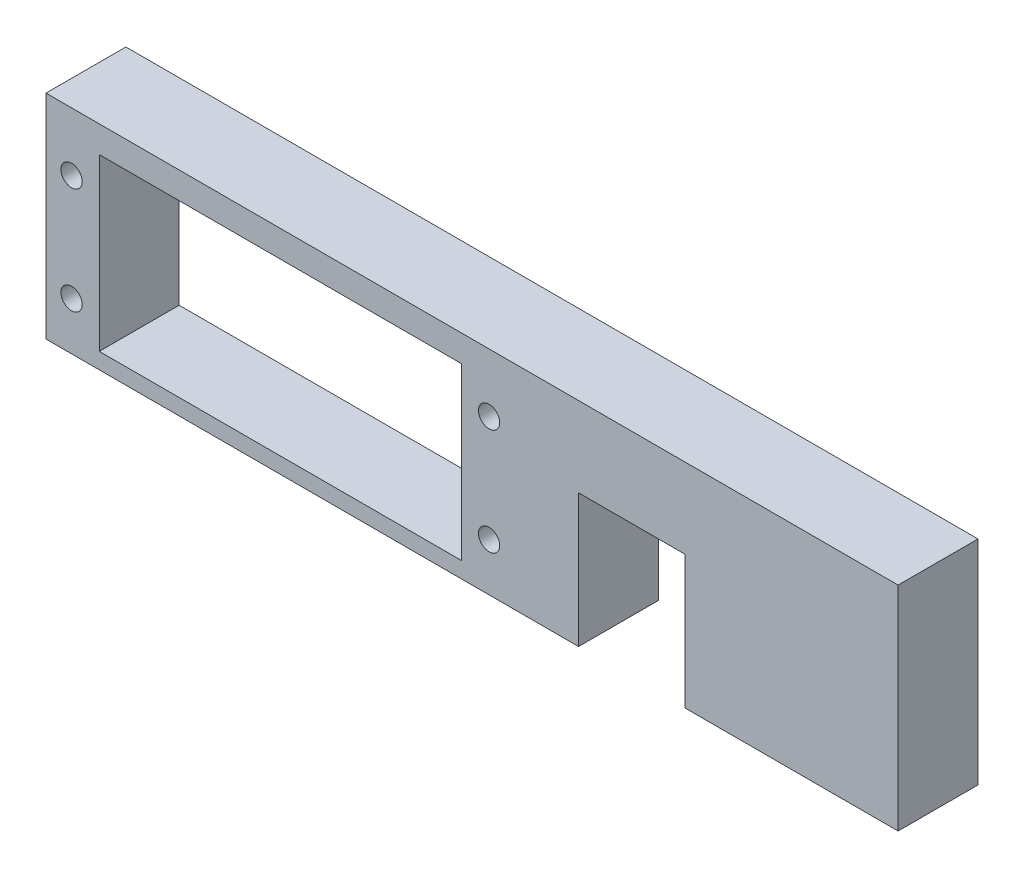
ISO-10303-21;
HEADER;
FILE_DESCRIPTION(('STEP AP214'),'2;1');
FILE_NAME('part.step','',(''),(''),'','','');
FILE_SCHEMA(('AUTOMOTIVE_DESIGN { 1 0 10303 214 1 1 1 1 }'));
ENDSEC;
DATA;
#1=APPLICATION_CONTEXT('core data for automotive mechanical design processes');
#2=APPLICATION_PROTOCOL_DEFINITION('international standard','automotive_design',2000,#1);
#3=PRODUCT_CONTEXT('',#1,'mechanical');
#4=PRODUCT('Part','Part','',(#3));
#5=PRODUCT_RELATED_PRODUCT_CATEGORY('part','',(#4));
#6=PRODUCT_DEFINITION_FORMATION('','',#4);
#7=PRODUCT_DEFINITION_CONTEXT('part definition',#1,'design');
#8=PRODUCT_DEFINITION('design','',#6,#7);
#9=PRODUCT_DEFINITION_SHAPE('','',#8);
#10=(LENGTH_UNIT() NAMED_UNIT(*) SI_UNIT(.MILLI.,.METRE.));
#11=(NAMED_UNIT(*) PLANE_ANGLE_UNIT() SI_UNIT($,.RADIAN.));
#12=(NAMED_UNIT(*) SI_UNIT($,.STERADIAN.) SOLID_ANGLE_UNIT());
#13=UNCERTAINTY_MEASURE_WITH_UNIT(LENGTH_MEASURE(1.E-05),#10,'distance_accuracy_value','');
#14=(GEOMETRIC_REPRESENTATION_CONTEXT(3) GLOBAL_UNCERTAINTY_ASSIGNED_CONTEXT((#13)) GLOBAL_UNIT_ASSIGNED_CONTEXT((#10,
#11,#12)) REPRESENTATION_CONTEXT('',''));
#15=CARTESIAN_POINT('',(0.,0.,0.));
#16=DIRECTION('',(0.,0.,1.));
#17=DIRECTION('',(1.,0.,0.));
#18=AXIS2_PLACEMENT_3D('',#15,#16,#17);
#19=CARTESIAN_POINT('',(0.,0.,9.525));
#20=DIRECTION('',(0.,0.,-1.));
#21=DIRECTION('',(-1.,0.,0.));
#22=AXIS2_PLACEMENT_3D('',#19,#20,#21);
#23=PLANE('',#22);
#24=CARTESIAN_POINT('',(52.832,18.415,9.525));
#25=DIRECTION('',(0.,0.,1.));
#26=DIRECTION('',(1.,0.,0.));
#27=AXIS2_PLACEMENT_3D('',#24,#25,#26);
#28=CIRCLE('',#27,1.27);
#29=CARTESIAN_POINT('',(54.102,18.415,9.525));
#30=VERTEX_POINT('',#29);
#31=EDGE_CURVE('E350',#30,#30,#28,.T.);
#32=ORIENTED_EDGE('',*,*,#31,.F.);
#33=EDGE_LOOP('',(#32));
#34=FACE_BOUND('',#33,.T.);
#35=CARTESIAN_POINT('',(3.04799999999999,18.415,9.525));
#36=DIRECTION('',(0.,0.,1.));
#37=DIRECTION('',(1.,0.,0.));
#38=AXIS2_PLACEMENT_3D('',#35,#36,#37);
#39=CIRCLE('',#38,1.27);
#40=CARTESIAN_POINT('',(4.31799999999999,18.415,9.525));
#41=VERTEX_POINT('',#40);
#42=EDGE_CURVE('E154',#41,#41,#39,.T.);
#43=ORIENTED_EDGE('',*,*,#42,.F.);
#44=EDGE_LOOP('',(#43));
#45=FACE_BOUND('',#44,.T.);
#46=DIRECTION('',(0.,-1.,0.));
#47=VECTOR('',#46,1.);
#48=CARTESIAN_POINT('',(0.,0.,9.525));
#49=LINE('',#48,#47);
#50=CARTESIAN_POINT('',(0.,25.4,9.525));
#51=VERTEX_POINT('',#50);
#52=CARTESIAN_POINT('',(0.,0.,9.525));
#53=VERTEX_POINT('',#52);
#54=EDGE_CURVE('E164',#51,#53,#49,.T.);
#55=ORIENTED_EDGE('',*,*,#54,.T.);
#56=DIRECTION('',(1.,0.,0.));
#57=VECTOR('',#56,1.);
#58=CARTESIAN_POINT('',(0.,0.,9.525));
#59=LINE('',#58,#57);
#60=CARTESIAN_POINT('',(63.5,0.,9.525));
#61=VERTEX_POINT('',#60);
#62=EDGE_CURVE('E167',#53,#61,#59,.T.);
#63=ORIENTED_EDGE('',*,*,#62,.T.);
#64=DIRECTION('',(0.,1.,0.));
#65=VECTOR('',#64,1.);
#66=CARTESIAN_POINT('',(63.5,0.,9.525));
#67=LINE('',#66,#65);
#68=CARTESIAN_POINT('',(63.5,15.875,9.525));
#69=VERTEX_POINT('',#68);
#70=EDGE_CURVE('E170',#61,#69,#67,.T.);
#71=ORIENTED_EDGE('',*,*,#70,.T.);
#72=DIRECTION('',(1.,0.,0.));
#73=VECTOR('',#72,1.);
#74=CARTESIAN_POINT('',(63.5,15.875,9.525));
#75=LINE('',#74,#73);
#76=CARTESIAN_POINT('',(76.2,15.875,9.525));
#77=VERTEX_POINT('',#76);
#78=EDGE_CURVE('E172',#69,#77,#75,.T.);
#79=ORIENTED_EDGE('',*,*,#78,.T.);
#80=DIRECTION('',(0.,-1.,0.));
#81=VECTOR('',#80,1.);
#82=CARTESIAN_POINT('',(76.2,15.875,9.525));
#83=LINE('',#82,#81);
#84=CARTESIAN_POINT('',(76.2,0.,9.525));
#85=VERTEX_POINT('',#84);
#86=EDGE_CURVE('E174',#77,#85,#83,.T.);
#87=ORIENTED_EDGE('',*,*,#86,.T.);
#88=DIRECTION('',(1.,0.,0.));
#89=VECTOR('',#88,1.);
#90=CARTESIAN_POINT('',(76.2,0.,9.525));
#91=LINE('',#90,#89);
#92=CARTESIAN_POINT('',(101.6,0.,9.525));
#93=VERTEX_POINT('',#92);
#94=EDGE_CURVE('E176',#85,#93,#91,.T.);
#95=ORIENTED_EDGE('',*,*,#94,.T.);
#96=DIRECTION('',(0.,1.,0.));
#97=VECTOR('',#96,1.);
#98=CARTESIAN_POINT('',(101.6,0.,9.525));
#99=LINE('',#98,#97);
#100=CARTESIAN_POINT('',(101.6,25.4,9.525));
#101=VERTEX_POINT('',#100);
#102=EDGE_CURVE('E178',#93,#101,#99,.T.);
#103=ORIENTED_EDGE('',*,*,#102,.T.);
#104=DIRECTION('',(-1.,0.,0.));
#105=VECTOR('',#104,1.);
#106=CARTESIAN_POINT('',(0.,25.4,9.525));
#107=LINE('',#106,#105);
#108=EDGE_CURVE('E180',#101,#51,#107,.T.);
#109=ORIENTED_EDGE('',*,*,#108,.T.);
#110=EDGE_LOOP('',(#55,#63,#71,#79,#87,#95,#103,#109));
#111=FACE_BOUND('',#110,.T.);
#112=DIRECTION('',(0.,-1.,0.));
#113=VECTOR('',#112,1.);
#114=CARTESIAN_POINT('',(6.35,22.225,9.525));
#115=LINE('',#114,#113);
#116=CARTESIAN_POINT('',(6.35,22.225,9.525));
#117=VERTEX_POINT('',#116);
#118=CARTESIAN_POINT('',(6.35,1.90500000000001,9.525));
#119=VERTEX_POINT('',#118);
#120=EDGE_CURVE('E125',#117,#119,#115,.T.);
#121=ORIENTED_EDGE('',*,*,#120,.F.);
#122=DIRECTION('',(-1.,0.,0.));
#123=VECTOR('',#122,1.);
#124=CARTESIAN_POINT('',(6.35,22.225,9.525));
#125=LINE('',#124,#123);
#126=CARTESIAN_POINT('',(49.53,22.225,9.525));
#127=VERTEX_POINT('',#126);
#128=EDGE_CURVE('E148',#127,#117,#125,.T.);
#129=ORIENTED_EDGE('',*,*,#128,.F.);
#130=DIRECTION('',(0.,1.,0.));
#131=VECTOR('',#130,1.);
#132=CARTESIAN_POINT('',(49.53,22.225,9.525));
#133=LINE('',#132,#131);
#134=CARTESIAN_POINT('',(49.53,1.90500000000001,9.525));
#135=VERTEX_POINT('',#134);
#136=EDGE_CURVE('E146',#135,#127,#133,.T.);
#137=ORIENTED_EDGE('',*,*,#136,.F.);
#138=DIRECTION('',(1.,0.,0.));
#139=VECTOR('',#138,1.);
#140=CARTESIAN_POINT('',(6.35,1.90500000000001,9.525));
#141=LINE('',#140,#139);
#142=EDGE_CURVE('E133',#119,#135,#141,.T.);
#143=ORIENTED_EDGE('',*,*,#142,.F.);
#144=EDGE_LOOP('',(#121,#129,#137,#143));
#145=FACE_BOUND('',#144,.T.);
#146=CARTESIAN_POINT('',(3.04799999999999,5.71500000000001,9.525));
#147=DIRECTION('',(0.,0.,1.));
#148=DIRECTION('',(1.,0.,0.));
#149=AXIS2_PLACEMENT_3D('',#146,#147,#148);
#150=CIRCLE('',#149,1.27);
#151=CARTESIAN_POINT('',(4.31799999999999,5.71500000000001,9.525));
#152=VERTEX_POINT('',#151);
#153=EDGE_CURVE('E356',#152,#152,#150,.T.);
#154=ORIENTED_EDGE('',*,*,#153,.F.);
#155=EDGE_LOOP('',(#154));
#156=FACE_BOUND('',#155,.T.);
#157=CARTESIAN_POINT('',(52.832,5.715,9.525));
#158=DIRECTION('',(0.,0.,1.));
#159=DIRECTION('',(1.,0.,0.));
#160=AXIS2_PLACEMENT_3D('',#157,#158,#159);
#161=CIRCLE('',#160,1.27);
#162=CARTESIAN_POINT('',(54.102,5.715,9.525));
#163=VERTEX_POINT('',#162);
#164=EDGE_CURVE('E344',#163,#163,#161,.T.);
#165=ORIENTED_EDGE('',*,*,#164,.F.);
#166=EDGE_LOOP('',(#165));
#167=FACE_BOUND('',#166,.T.);
#168=ADVANCED_FACE('F36',(#34,#45,#111,#145,#156,#167),#23,.F.);
#169=CARTESIAN_POINT('',(0.,0.,0.));
#170=DIRECTION('',(0.,0.,-1.));
#171=DIRECTION('',(-1.,0.,0.));
#172=AXIS2_PLACEMENT_3D('',#169,#170,#171);
#173=PLANE('',#172);
#174=CARTESIAN_POINT('',(52.832,18.415,0.));
#175=DIRECTION('',(0.,0.,1.));
#176=DIRECTION('',(1.,0.,0.));
#177=AXIS2_PLACEMENT_3D('',#174,#175,#176);
#178=CIRCLE('',#177,1.27);
#179=CARTESIAN_POINT('',(54.102,18.415,0.));
#180=VERTEX_POINT('',#179);
#181=EDGE_CURVE('E347',#180,#180,#178,.T.);
#182=ORIENTED_EDGE('',*,*,#181,.T.);
#183=EDGE_LOOP('',(#182));
#184=FACE_BOUND('',#183,.T.);
#185=CARTESIAN_POINT('',(3.04799999999999,18.415,0.));
#186=DIRECTION('',(0.,0.,1.));
#187=DIRECTION('',(1.,0.,0.));
#188=AXIS2_PLACEMENT_3D('',#185,#186,#187);
#189=CIRCLE('',#188,1.27);
#190=CARTESIAN_POINT('',(4.31799999999999,18.415,0.));
#191=VERTEX_POINT('',#190);
#192=EDGE_CURVE('E359',#191,#191,#189,.T.);
#193=ORIENTED_EDGE('',*,*,#192,.T.);
#194=EDGE_LOOP('',(#193));
#195=FACE_BOUND('',#194,.T.);
#196=DIRECTION('',(0.,-1.,0.));
#197=VECTOR('',#196,1.);
#198=CARTESIAN_POINT('',(0.,0.,0.));
#199=LINE('',#198,#197);
#200=CARTESIAN_POINT('',(0.,25.4,0.));
#201=VERTEX_POINT('',#200);
#202=CARTESIAN_POINT('',(0.,0.,0.));
#203=VERTEX_POINT('',#202);
#204=EDGE_CURVE('E141',#201,#203,#199,.T.);
#205=ORIENTED_EDGE('',*,*,#204,.F.);
#206=DIRECTION('',(-1.,0.,0.));
#207=VECTOR('',#206,1.);
#208=CARTESIAN_POINT('',(0.,25.4,0.));
#209=LINE('',#208,#207);
#210=CARTESIAN_POINT('',(101.6,25.4,0.));
#211=VERTEX_POINT('',#210);
#212=EDGE_CURVE('E168',#211,#201,#209,.T.);
#213=ORIENTED_EDGE('',*,*,#212,.F.);
#214=DIRECTION('',(0.,1.,0.));
#215=VECTOR('',#214,1.);
#216=CARTESIAN_POINT('',(101.6,0.,0.));
#217=LINE('',#216,#215);
#218=CARTESIAN_POINT('',(101.6,0.,0.));
#219=VERTEX_POINT('',#218);
#220=EDGE_CURVE('E195',#219,#211,#217,.T.);
#221=ORIENTED_EDGE('',*,*,#220,.F.);
#222=DIRECTION('',(1.,0.,0.));
#223=VECTOR('',#222,1.);
#224=CARTESIAN_POINT('',(76.2,0.,0.));
#225=LINE('',#224,#223);
#226=CARTESIAN_POINT('',(76.2,0.,0.));
#227=VERTEX_POINT('',#226);
#228=EDGE_CURVE('E193',#227,#219,#225,.T.);
#229=ORIENTED_EDGE('',*,*,#228,.F.);
#230=DIRECTION('',(0.,-1.,0.));
#231=VECTOR('',#230,1.);
#232=CARTESIAN_POINT('',(76.2,15.875,0.));
#233=LINE('',#232,#231);
#234=CARTESIAN_POINT('',(76.2,15.875,0.));
#235=VERTEX_POINT('',#234);
#236=EDGE_CURVE('E191',#235,#227,#233,.T.);
#237=ORIENTED_EDGE('',*,*,#236,.F.);
#238=DIRECTION('',(1.,0.,0.));
#239=VECTOR('',#238,1.);
#240=CARTESIAN_POINT('',(63.5,15.875,0.));
#241=LINE('',#240,#239);
#242=CARTESIAN_POINT('',(63.5,15.875,0.));
#243=VERTEX_POINT('',#242);
#244=EDGE_CURVE('E189',#243,#235,#241,.T.);
#245=ORIENTED_EDGE('',*,*,#244,.F.);
#246=DIRECTION('',(0.,1.,0.));
#247=VECTOR('',#246,1.);
#248=CARTESIAN_POINT('',(63.5,0.,0.));
#249=LINE('',#248,#247);
#250=CARTESIAN_POINT('',(63.5,0.,0.));
#251=VERTEX_POINT('',#250);
#252=EDGE_CURVE('E187',#251,#243,#249,.T.);
#253=ORIENTED_EDGE('',*,*,#252,.F.);
#254=DIRECTION('',(1.,0.,0.));
#255=VECTOR('',#254,1.);
#256=CARTESIAN_POINT('',(0.,0.,0.));
#257=LINE('',#256,#255);
#258=EDGE_CURVE('E185',#203,#251,#257,.T.);
#259=ORIENTED_EDGE('',*,*,#258,.F.);
#260=EDGE_LOOP('',(#205,#213,#221,#229,#237,#245,#253,#259));
#261=FACE_BOUND('',#260,.T.);
#262=DIRECTION('',(-1.,0.,0.));
#263=VECTOR('',#262,1.);
#264=CARTESIAN_POINT('',(6.35,22.225,0.));
#265=LINE('',#264,#263);
#266=CARTESIAN_POINT('',(49.53,22.225,0.));
#267=VERTEX_POINT('',#266);
#268=CARTESIAN_POINT('',(6.35,22.225,0.));
#269=VERTEX_POINT('',#268);
#270=EDGE_CURVE('E134',#267,#269,#265,.T.);
#271=ORIENTED_EDGE('',*,*,#270,.T.);
#272=DIRECTION('',(0.,-1.,0.));
#273=VECTOR('',#272,1.);
#274=CARTESIAN_POINT('',(6.35,22.225,0.));
#275=LINE('',#274,#273);
#276=CARTESIAN_POINT('',(6.35,1.90500000000001,0.));
#277=VERTEX_POINT('',#276);
#278=EDGE_CURVE('E59',#269,#277,#275,.T.);
#279=ORIENTED_EDGE('',*,*,#278,.T.);
#280=DIRECTION('',(1.,0.,0.));
#281=VECTOR('',#280,1.);
#282=CARTESIAN_POINT('',(6.35,1.90500000000001,0.));
#283=LINE('',#282,#281);
#284=CARTESIAN_POINT('',(49.53,1.90500000000001,0.));
#285=VERTEX_POINT('',#284);
#286=EDGE_CURVE('E140',#277,#285,#283,.T.);
#287=ORIENTED_EDGE('',*,*,#286,.T.);
#288=DIRECTION('',(0.,1.,0.));
#289=VECTOR('',#288,1.);
#290=CARTESIAN_POINT('',(49.53,22.225,0.));
#291=LINE('',#290,#289);
#292=EDGE_CURVE('E156',#285,#267,#291,.T.);
#293=ORIENTED_EDGE('',*,*,#292,.T.);
#294=EDGE_LOOP('',(#271,#279,#287,#293));
#295=FACE_BOUND('',#294,.T.);
#296=CARTESIAN_POINT('',(3.04799999999999,5.71500000000001,0.));
#297=DIRECTION('',(0.,0.,1.));
#298=DIRECTION('',(1.,0.,0.));
#299=AXIS2_PLACEMENT_3D('',#296,#297,#298);
#300=CIRCLE('',#299,1.27);
#301=CARTESIAN_POINT('',(4.31799999999999,5.71500000000001,0.));
#302=VERTEX_POINT('',#301);
#303=EDGE_CURVE('E353',#302,#302,#300,.T.);
#304=ORIENTED_EDGE('',*,*,#303,.T.);
#305=EDGE_LOOP('',(#304));
#306=FACE_BOUND('',#305,.T.);
#307=CARTESIAN_POINT('',(52.832,5.715,0.));
#308=DIRECTION('',(0.,0.,1.));
#309=DIRECTION('',(1.,0.,0.));
#310=AXIS2_PLACEMENT_3D('',#307,#308,#309);
#311=CIRCLE('',#310,1.27);
#312=CARTESIAN_POINT('',(54.102,5.715,0.));
#313=VERTEX_POINT('',#312);
#314=EDGE_CURVE('E342',#313,#313,#311,.T.);
#315=ORIENTED_EDGE('',*,*,#314,.T.);
#316=EDGE_LOOP('',(#315));
#317=FACE_BOUND('',#316,.T.);
#318=ADVANCED_FACE('F225',(#184,#195,#261,#295,#306,#317),#173,.T.);
#319=CARTESIAN_POINT('',(0.,0.,9.525));
#320=DIRECTION('',(1.,0.,0.));
#321=DIRECTION('',(0.,0.,-1.));
#322=AXIS2_PLACEMENT_3D('',#319,#320,#321);
#323=PLANE('',#322);
#324=ORIENTED_EDGE('',*,*,#204,.T.);
#325=DIRECTION('',(0.,0.,-1.));
#326=VECTOR('',#325,1.);
#327=CARTESIAN_POINT('',(0.,0.,9.525));
#328=LINE('',#327,#326);
#329=EDGE_CURVE('E12',#53,#203,#328,.T.);
#330=ORIENTED_EDGE('',*,*,#329,.F.);
#331=ORIENTED_EDGE('',*,*,#54,.F.);
#332=DIRECTION('',(0.,0.,-1.));
#333=VECTOR('',#332,1.);
#334=CARTESIAN_POINT('',(0.,25.4,9.525));
#335=LINE('',#334,#333);
#336=EDGE_CURVE('E182',#51,#201,#335,.T.);
#337=ORIENTED_EDGE('',*,*,#336,.T.);
#338=EDGE_LOOP('',(#324,#330,#331,#337));
#339=FACE_BOUND('',#338,.T.);
#340=ADVANCED_FACE('F38',(#339),#323,.F.);
#341=CARTESIAN_POINT('',(0.,0.,9.525));
#342=DIRECTION('',(0.,1.,0.));
#343=DIRECTION('',(0.,0.,1.));
#344=AXIS2_PLACEMENT_3D('',#341,#342,#343);
#345=PLANE('',#344);
#346=CARTESIAN_POINT('',(60.2488,0.,4.7625));
#347=DIRECTION('',(0.,-1.,0.));
#348=DIRECTION('',(0.,0.,-1.));
#349=AXIS2_PLACEMENT_3D('',#346,#347,#348);
#350=CIRCLE('',#349,1.7272);
#351=CARTESIAN_POINT('',(60.2488,0.,3.0353));
#352=VERTEX_POINT('',#351);
#353=EDGE_CURVE('E332',#352,#352,#350,.T.);
#354=ORIENTED_EDGE('',*,*,#353,.F.);
#355=EDGE_LOOP('',(#354));
#356=FACE_BOUND('',#355,.T.);
#357=ORIENTED_EDGE('',*,*,#258,.T.);
#358=DIRECTION('',(0.,0.,-1.));
#359=VECTOR('',#358,1.);
#360=CARTESIAN_POINT('',(63.5,0.,9.525));
#361=LINE('',#360,#359);
#362=EDGE_CURVE('E44',#61,#251,#361,.T.);
#363=ORIENTED_EDGE('',*,*,#362,.F.);
#364=ORIENTED_EDGE('',*,*,#62,.F.);
#365=ORIENTED_EDGE('',*,*,#329,.T.);
#366=EDGE_LOOP('',(#357,#363,#364,#365));
#367=FACE_BOUND('',#366,.T.);
#368=ADVANCED_FACE('F242',(#356,#367),#345,.F.);
#369=CARTESIAN_POINT('',(63.5,0.,9.525));
#370=DIRECTION('',(-1.,0.,0.));
#371=DIRECTION('',(0.,0.,1.));
#372=AXIS2_PLACEMENT_3D('',#369,#370,#371);
#373=PLANE('',#372);
#374=ORIENTED_EDGE('',*,*,#252,.T.);
#375=DIRECTION('',(0.,0.,-1.));
#376=VECTOR('',#375,1.);
#377=CARTESIAN_POINT('',(63.5,15.875,9.525));
#378=LINE('',#377,#376);
#379=EDGE_CURVE('E212',#69,#243,#378,.T.);
#380=ORIENTED_EDGE('',*,*,#379,.F.);
#381=ORIENTED_EDGE('',*,*,#70,.F.);
#382=ORIENTED_EDGE('',*,*,#362,.T.);
#383=EDGE_LOOP('',(#374,#380,#381,#382));
#384=FACE_BOUND('',#383,.T.);
#385=ADVANCED_FACE('F219',(#384),#373,.F.);
#386=CARTESIAN_POINT('',(63.5,15.875,9.525));
#387=DIRECTION('',(0.,1.,0.));
#388=DIRECTION('',(0.,0.,1.));
#389=AXIS2_PLACEMENT_3D('',#386,#387,#388);
#390=PLANE('',#389);
#391=ORIENTED_EDGE('',*,*,#244,.T.);
#392=DIRECTION('',(0.,0.,-1.));
#393=VECTOR('',#392,1.);
#394=CARTESIAN_POINT('',(76.2,15.875,9.525));
#395=LINE('',#394,#393);
#396=EDGE_CURVE('E209',#77,#235,#395,.T.);
#397=ORIENTED_EDGE('',*,*,#396,.F.);
#398=ORIENTED_EDGE('',*,*,#78,.F.);
#399=ORIENTED_EDGE('',*,*,#379,.T.);
#400=EDGE_LOOP('',(#391,#397,#398,#399));
#401=FACE_BOUND('',#400,.T.);
#402=ADVANCED_FACE('F231',(#401),#390,.F.);
#403=CARTESIAN_POINT('',(76.2,15.875,9.525));
#404=DIRECTION('',(1.,0.,0.));
#405=DIRECTION('',(0.,0.,-1.));
#406=AXIS2_PLACEMENT_3D('',#403,#404,#405);
#407=PLANE('',#406);
#408=ORIENTED_EDGE('',*,*,#236,.T.);
#409=DIRECTION('',(0.,0.,-1.));
#410=VECTOR('',#409,1.);
#411=CARTESIAN_POINT('',(76.2,0.,9.525));
#412=LINE('',#411,#410);
#413=EDGE_CURVE('E206',#85,#227,#412,.T.);
#414=ORIENTED_EDGE('',*,*,#413,.F.);
#415=ORIENTED_EDGE('',*,*,#86,.F.);
#416=ORIENTED_EDGE('',*,*,#396,.T.);
#417=EDGE_LOOP('',(#408,#414,#415,#416));
#418=FACE_BOUND('',#417,.T.);
#419=ADVANCED_FACE('F235',(#418),#407,.F.);
#420=CARTESIAN_POINT('',(76.2,0.,9.525));
#421=DIRECTION('',(0.,1.,0.));
#422=DIRECTION('',(0.,0.,1.));
#423=AXIS2_PLACEMENT_3D('',#420,#421,#422);
#424=PLANE('',#423);
#425=CARTESIAN_POINT('',(79.2988,0.,4.7625));
#426=DIRECTION('',(0.,-1.,0.));
#427=DIRECTION('',(0.,0.,-1.));
#428=AXIS2_PLACEMENT_3D('',#425,#426,#427);
#429=CIRCLE('',#428,1.7272);
#430=CARTESIAN_POINT('',(79.2988,0.,3.0353));
#431=VERTEX_POINT('',#430);
#432=EDGE_CURVE('E333',#431,#431,#429,.T.);
#433=ORIENTED_EDGE('',*,*,#432,.F.);
#434=EDGE_LOOP('',(#433));
#435=FACE_BOUND('',#434,.T.);
#436=ORIENTED_EDGE('',*,*,#228,.T.);
#437=DIRECTION('',(0.,0.,-1.));
#438=VECTOR('',#437,1.);
#439=CARTESIAN_POINT('',(101.6,0.,9.525));
#440=LINE('',#439,#438);
#441=EDGE_CURVE('E203',#93,#219,#440,.T.);
#442=ORIENTED_EDGE('',*,*,#441,.F.);
#443=ORIENTED_EDGE('',*,*,#94,.F.);
#444=ORIENTED_EDGE('',*,*,#413,.T.);
#445=EDGE_LOOP('',(#436,#442,#443,#444));
#446=FACE_BOUND('',#445,.T.);
#447=ADVANCED_FACE('F255',(#435,#446),#424,.F.);
#448=CARTESIAN_POINT('',(101.6,0.,9.525));
#449=DIRECTION('',(-1.,0.,0.));
#450=DIRECTION('',(0.,0.,1.));
#451=AXIS2_PLACEMENT_3D('',#448,#449,#450);
#452=PLANE('',#451);
#453=ORIENTED_EDGE('',*,*,#220,.T.);
#454=DIRECTION('',(0.,0.,-1.));
#455=VECTOR('',#454,1.);
#456=CARTESIAN_POINT('',(101.6,25.4,9.525));
#457=LINE('',#456,#455);
#458=EDGE_CURVE('E200',#101,#211,#457,.T.);
#459=ORIENTED_EDGE('',*,*,#458,.F.);
#460=ORIENTED_EDGE('',*,*,#102,.F.);
#461=ORIENTED_EDGE('',*,*,#441,.T.);
#462=EDGE_LOOP('',(#453,#459,#460,#461));
#463=FACE_BOUND('',#462,.T.);
#464=ADVANCED_FACE('F253',(#463),#452,.F.);
#465=CARTESIAN_POINT('',(0.,25.4,9.525));
#466=DIRECTION('',(0.,-1.,0.));
#467=DIRECTION('',(0.,0.,-1.));
#468=AXIS2_PLACEMENT_3D('',#465,#466,#467);
#469=PLANE('',#468);
#470=ORIENTED_EDGE('',*,*,#212,.T.);
#471=ORIENTED_EDGE('',*,*,#336,.F.);
#472=ORIENTED_EDGE('',*,*,#108,.F.);
#473=ORIENTED_EDGE('',*,*,#458,.T.);
#474=EDGE_LOOP('',(#470,#471,#472,#473));
#475=FACE_BOUND('',#474,.T.);
#476=ADVANCED_FACE('F248',(#475),#469,.F.);
#477=CARTESIAN_POINT('',(6.35,22.225,9.525));
#478=DIRECTION('',(1.,0.,0.));
#479=DIRECTION('',(0.,1.,0.));
#480=AXIS2_PLACEMENT_3D('',#477,#478,#479);
#481=PLANE('',#480);
#482=ORIENTED_EDGE('',*,*,#278,.F.);
#483=DIRECTION('',(0.,0.,-1.));
#484=VECTOR('',#483,1.);
#485=CARTESIAN_POINT('',(6.35,22.225,9.525));
#486=LINE('',#485,#484);
#487=EDGE_CURVE('E129',#117,#269,#486,.T.);
#488=ORIENTED_EDGE('',*,*,#487,.F.);
#489=ORIENTED_EDGE('',*,*,#120,.T.);
#490=DIRECTION('',(0.,0.,-1.));
#491=VECTOR('',#490,1.);
#492=CARTESIAN_POINT('',(6.35,1.90500000000001,9.525));
#493=LINE('',#492,#491);
#494=EDGE_CURVE('E128',#119,#277,#493,.T.);
#495=ORIENTED_EDGE('',*,*,#494,.T.);
#496=EDGE_LOOP('',(#482,#488,#489,#495));
#497=FACE_BOUND('',#496,.T.);
#498=ADVANCED_FACE('F127',(#497),#481,.T.);
#499=CARTESIAN_POINT('',(6.35,1.90500000000001,9.525));
#500=DIRECTION('',(0.,1.,0.));
#501=DIRECTION('',(0.,0.,1.));
#502=AXIS2_PLACEMENT_3D('',#499,#500,#501);
#503=PLANE('',#502);
#504=ORIENTED_EDGE('',*,*,#286,.F.);
#505=ORIENTED_EDGE('',*,*,#494,.F.);
#506=ORIENTED_EDGE('',*,*,#142,.T.);
#507=DIRECTION('',(0.,0.,-1.));
#508=VECTOR('',#507,1.);
#509=CARTESIAN_POINT('',(49.53,1.90500000000001,9.525));
#510=LINE('',#509,#508);
#511=EDGE_CURVE('E142',#135,#285,#510,.T.);
#512=ORIENTED_EDGE('',*,*,#511,.T.);
#513=EDGE_LOOP('',(#504,#505,#506,#512));
#514=FACE_BOUND('',#513,.T.);
#515=ADVANCED_FACE('F137',(#514),#503,.T.);
#516=CARTESIAN_POINT('',(49.53,22.225,9.525));
#517=DIRECTION('',(-1.,0.,0.));
#518=DIRECTION('',(0.,0.,1.));
#519=AXIS2_PLACEMENT_3D('',#516,#517,#518);
#520=PLANE('',#519);
#521=ORIENTED_EDGE('',*,*,#292,.F.);
#522=ORIENTED_EDGE('',*,*,#511,.F.);
#523=ORIENTED_EDGE('',*,*,#136,.T.);
#524=DIRECTION('',(0.,0.,-1.));
#525=VECTOR('',#524,1.);
#526=CARTESIAN_POINT('',(49.53,22.225,9.525));
#527=LINE('',#526,#525);
#528=EDGE_CURVE('E51',#127,#267,#527,.T.);
#529=ORIENTED_EDGE('',*,*,#528,.T.);
#530=EDGE_LOOP('',(#521,#522,#523,#529));
#531=FACE_BOUND('',#530,.T.);
#532=ADVANCED_FACE('F286',(#531),#520,.T.);
#533=CARTESIAN_POINT('',(6.35,22.225,9.525));
#534=DIRECTION('',(0.,-1.,0.));
#535=DIRECTION('',(0.,0.,-1.));
#536=AXIS2_PLACEMENT_3D('',#533,#534,#535);
#537=PLANE('',#536);
#538=ORIENTED_EDGE('',*,*,#270,.F.);
#539=ORIENTED_EDGE('',*,*,#528,.F.);
#540=ORIENTED_EDGE('',*,*,#128,.T.);
#541=ORIENTED_EDGE('',*,*,#487,.T.);
#542=EDGE_LOOP('',(#538,#539,#540,#541));
#543=FACE_BOUND('',#542,.T.);
#544=ADVANCED_FACE('F290',(#543),#537,.T.);
#545=CARTESIAN_POINT('',(3.04799999999999,18.415,9.525));
#546=DIRECTION('',(0.,0.,-1.));
#547=DIRECTION('',(-1.,0.,0.));
#548=AXIS2_PLACEMENT_3D('',#545,#546,#547);
#549=CYLINDRICAL_SURFACE('',#548,1.27);
#550=ORIENTED_EDGE('',*,*,#42,.T.);
#551=EDGE_LOOP('',(#550));
#552=FACE_BOUND('',#551,.T.);
#553=ORIENTED_EDGE('',*,*,#192,.F.);
#554=EDGE_LOOP('',(#553));
#555=FACE_BOUND('',#554,.T.);
#556=ADVANCED_FACE('F296',(#552,#555),#549,.F.);
#557=CARTESIAN_POINT('',(3.04799999999999,5.71500000000001,9.525));
#558=DIRECTION('',(0.,0.,-1.));
#559=DIRECTION('',(-1.,0.,0.));
#560=AXIS2_PLACEMENT_3D('',#557,#558,#559);
#561=CYLINDRICAL_SURFACE('',#560,1.27);
#562=ORIENTED_EDGE('',*,*,#153,.T.);
#563=EDGE_LOOP('',(#562));
#564=FACE_BOUND('',#563,.T.);
#565=ORIENTED_EDGE('',*,*,#303,.F.);
#566=EDGE_LOOP('',(#565));
#567=FACE_BOUND('',#566,.T.);
#568=ADVANCED_FACE('F299',(#564,#567),#561,.F.);
#569=CARTESIAN_POINT('',(52.832,18.415,9.525));
#570=DIRECTION('',(0.,0.,-1.));
#571=DIRECTION('',(-1.,0.,0.));
#572=AXIS2_PLACEMENT_3D('',#569,#570,#571);
#573=CYLINDRICAL_SURFACE('',#572,1.27);
#574=ORIENTED_EDGE('',*,*,#31,.T.);
#575=EDGE_LOOP('',(#574));
#576=FACE_BOUND('',#575,.T.);
#577=ORIENTED_EDGE('',*,*,#181,.F.);
#578=EDGE_LOOP('',(#577));
#579=FACE_BOUND('',#578,.T.);
#580=ADVANCED_FACE('F303',(#576,#579),#573,.F.);
#581=CARTESIAN_POINT('',(52.832,5.715,9.525));
#582=DIRECTION('',(0.,0.,-1.));
#583=DIRECTION('',(-1.,0.,0.));
#584=AXIS2_PLACEMENT_3D('',#581,#582,#583);
#585=CYLINDRICAL_SURFACE('',#584,1.27);
#586=ORIENTED_EDGE('',*,*,#164,.T.);
#587=EDGE_LOOP('',(#586));
#588=FACE_BOUND('',#587,.T.);
#589=ORIENTED_EDGE('',*,*,#314,.F.);
#590=EDGE_LOOP('',(#589));
#591=FACE_BOUND('',#590,.T.);
#592=ADVANCED_FACE('F307',(#588,#591),#585,.F.);
#593=CARTESIAN_POINT('',(60.2488,12.7,4.7625));
#594=DIRECTION('',(0.,-1.,0.));
#595=DIRECTION('',(0.,0.,-1.));
#596=AXIS2_PLACEMENT_3D('',#593,#594,#595);
#597=CYLINDRICAL_SURFACE('',#596,1.7272);
#598=CARTESIAN_POINT('',(60.2488,12.7,4.7625));
#599=DIRECTION('',(0.,-1.,0.));
#600=DIRECTION('',(0.,0.,-1.));
#601=AXIS2_PLACEMENT_3D('',#598,#599,#600);
#602=CIRCLE('',#601,1.7272);
#603=CARTESIAN_POINT('',(60.2488,12.7,3.0353));
#604=VERTEX_POINT('',#603);
#605=EDGE_CURVE('E336',#604,#604,#602,.T.);
#606=ORIENTED_EDGE('',*,*,#605,.F.);
#607=EDGE_LOOP('',(#606));
#608=FACE_BOUND('',#607,.T.);
#609=ORIENTED_EDGE('',*,*,#353,.T.);
#610=EDGE_LOOP('',(#609));
#611=FACE_BOUND('',#610,.T.);
#612=ADVANCED_FACE('F311',(#608,#611),#597,.F.);
#613=CARTESIAN_POINT('',(60.2488,12.7,4.7625));
#614=DIRECTION('',(0.,-1.,0.));
#615=DIRECTION('',(0.,0.,-1.));
#616=AXIS2_PLACEMENT_3D('',#613,#614,#615);
#617=PLANE('',#616);
#618=ORIENTED_EDGE('',*,*,#605,.T.);
#619=EDGE_LOOP('',(#618));
#620=FACE_BOUND('',#619,.T.);
#621=ADVANCED_FACE('F315',(#620),#617,.T.);
#622=CARTESIAN_POINT('',(79.2988,12.7,4.7625));
#623=DIRECTION('',(0.,-1.,0.));
#624=DIRECTION('',(0.,0.,-1.));
#625=AXIS2_PLACEMENT_3D('',#622,#623,#624);
#626=CYLINDRICAL_SURFACE('',#625,1.7272);
#627=CARTESIAN_POINT('',(79.2988,12.7,4.7625));
#628=DIRECTION('',(0.,-1.,0.));
#629=DIRECTION('',(0.,0.,-1.));
#630=AXIS2_PLACEMENT_3D('',#627,#628,#629);
#631=CIRCLE('',#630,1.7272);
#632=CARTESIAN_POINT('',(79.2988,12.7,3.0353));
#633=VERTEX_POINT('',#632);
#634=EDGE_CURVE('E331',#633,#633,#631,.T.);
#635=ORIENTED_EDGE('',*,*,#634,.F.);
#636=EDGE_LOOP('',(#635));
#637=FACE_BOUND('',#636,.T.);
#638=ORIENTED_EDGE('',*,*,#432,.T.);
#639=EDGE_LOOP('',(#638));
#640=FACE_BOUND('',#639,.T.);
#641=ADVANCED_FACE('F319',(#637,#640),#626,.F.);
#642=CARTESIAN_POINT('',(79.2988,12.7,4.7625));
#643=DIRECTION('',(0.,-1.,0.));
#644=DIRECTION('',(0.,0.,-1.));
#645=AXIS2_PLACEMENT_3D('',#642,#643,#644);
#646=PLANE('',#645);
#647=ORIENTED_EDGE('',*,*,#634,.T.);
#648=EDGE_LOOP('',(#647));
#649=FACE_BOUND('',#648,.T.);
#650=ADVANCED_FACE('F323',(#649),#646,.T.);
#651=CLOSED_SHELL('',(#168,#318,#340,#368,#385,#402,#419,#447,#464,#476,#498,#515,#532,#544,
#556,#568,#580,#592,#612,#621,#641,#650));
#652=MANIFOLD_SOLID_BREP('B2',#651);
#653=ADVANCED_BREP_SHAPE_REPRESENTATION('',(#18,#652),#14);
#654=SHAPE_DEFINITION_REPRESENTATION(#9,#653);
ENDSEC;
END-ISO-10303-21;
